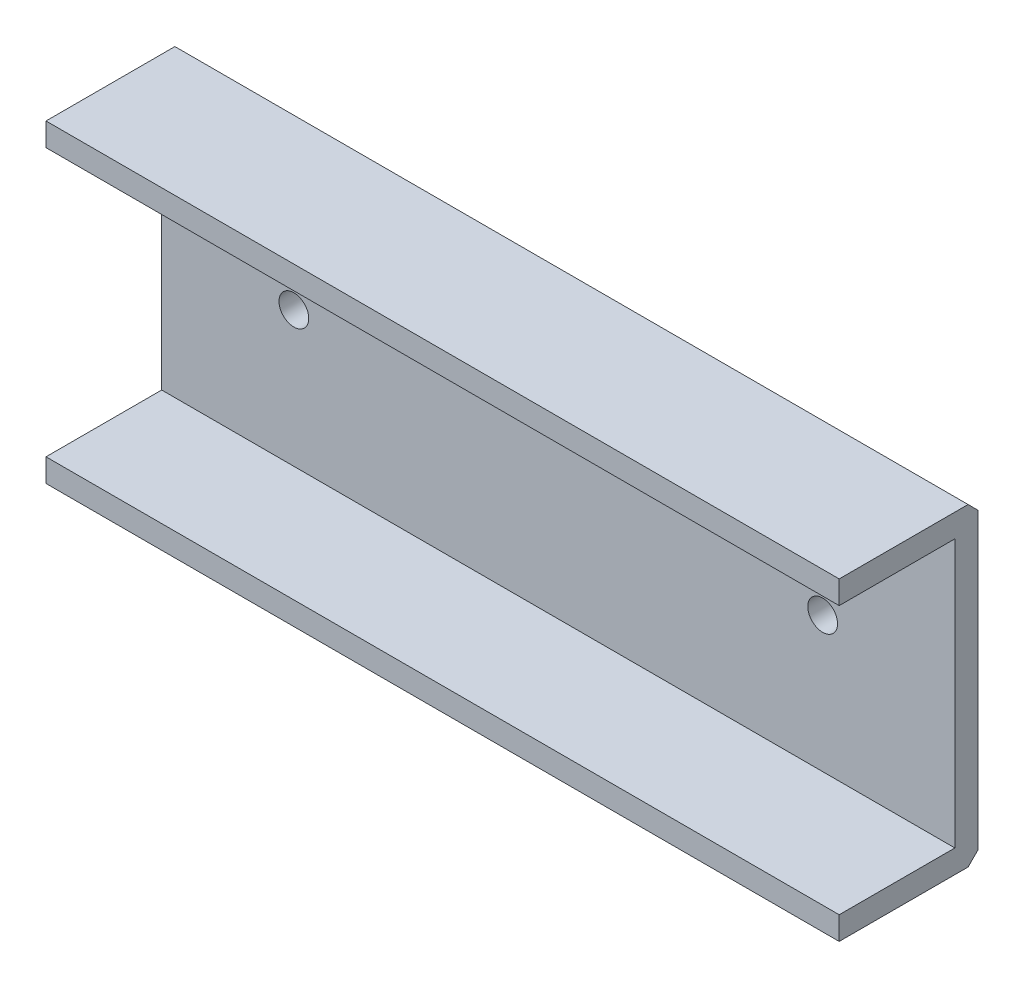
ISO-10303-21;
HEADER;
FILE_DESCRIPTION(('STEP AP214'),'2;1');
FILE_NAME('part.step','',(''),(''),'','','');
FILE_SCHEMA(('AUTOMOTIVE_DESIGN { 1 0 10303 214 1 1 1 1 }'));
ENDSEC;
DATA;
#1=APPLICATION_CONTEXT('core data for automotive mechanical design processes');
#2=APPLICATION_PROTOCOL_DEFINITION('international standard','automotive_design',2000,#1);
#3=PRODUCT_CONTEXT('',#1,'mechanical');
#4=PRODUCT('Part','Part','',(#3));
#5=PRODUCT_RELATED_PRODUCT_CATEGORY('part','',(#4));
#6=PRODUCT_DEFINITION_FORMATION('','',#4);
#7=PRODUCT_DEFINITION_CONTEXT('part definition',#1,'design');
#8=PRODUCT_DEFINITION('design','',#6,#7);
#9=PRODUCT_DEFINITION_SHAPE('','',#8);
#10=(LENGTH_UNIT() NAMED_UNIT(*) SI_UNIT(.MILLI.,.METRE.));
#11=(NAMED_UNIT(*) PLANE_ANGLE_UNIT() SI_UNIT($,.RADIAN.));
#12=(NAMED_UNIT(*) SI_UNIT($,.STERADIAN.) SOLID_ANGLE_UNIT());
#13=UNCERTAINTY_MEASURE_WITH_UNIT(LENGTH_MEASURE(1.E-05),#10,'distance_accuracy_value','');
#14=(GEOMETRIC_REPRESENTATION_CONTEXT(3) GLOBAL_UNCERTAINTY_ASSIGNED_CONTEXT((#13)) GLOBAL_UNIT_ASSIGNED_CONTEXT((#10,
#11,#12)) REPRESENTATION_CONTEXT('',''));
#15=CARTESIAN_POINT('',(0.,0.,0.));
#16=DIRECTION('',(0.,0.,1.));
#17=DIRECTION('',(1.,0.,0.));
#18=AXIS2_PLACEMENT_3D('',#15,#16,#17);
#19=CARTESIAN_POINT('',(60.,23.75,0.));
#20=DIRECTION('',(0.,-1.,0.));
#21=DIRECTION('',(0.,0.,-1.));
#22=AXIS2_PLACEMENT_3D('',#19,#20,#21);
#23=PLANE('',#22);
#24=DIRECTION('',(0.,0.,1.));
#25=VECTOR('',#24,1.);
#26=CARTESIAN_POINT('',(60.,23.75,0.));
#27=LINE('',#26,#25);
#28=CARTESIAN_POINT('',(60.,23.75,1.49999999999999));
#29=VERTEX_POINT('',#28);
#30=CARTESIAN_POINT('',(60.,23.75,21.));
#31=VERTEX_POINT('',#30);
#32=EDGE_CURVE('E120',#29,#31,#27,.T.);
#33=ORIENTED_EDGE('',*,*,#32,.F.);
#34=DIRECTION('',(-1.,0.,0.));
#35=VECTOR('',#34,1.);
#36=CARTESIAN_POINT('',(60.,23.75,1.49999999999999));
#37=LINE('',#36,#35);
#38=CARTESIAN_POINT('',(-60.,23.75,1.49999999999999));
#39=VERTEX_POINT('',#38);
#40=EDGE_CURVE('E11',#29,#39,#37,.T.);
#41=ORIENTED_EDGE('',*,*,#40,.T.);
#42=DIRECTION('',(0.,0.,1.));
#43=VECTOR('',#42,1.);
#44=CARTESIAN_POINT('',(-60.,23.75,0.));
#45=LINE('',#44,#43);
#46=CARTESIAN_POINT('',(-60.,23.75,21.));
#47=VERTEX_POINT('',#46);
#48=EDGE_CURVE('E142',#39,#47,#45,.T.);
#49=ORIENTED_EDGE('',*,*,#48,.T.);
#50=DIRECTION('',(-1.,0.,0.));
#51=VECTOR('',#50,1.);
#52=CARTESIAN_POINT('',(60.,23.75,21.));
#53=LINE('',#52,#51);
#54=EDGE_CURVE('E134',#31,#47,#53,.T.);
#55=ORIENTED_EDGE('',*,*,#54,.F.);
#56=EDGE_LOOP('',(#33,#41,#49,#55));
#57=FACE_BOUND('',#56,.T.);
#58=ADVANCED_FACE('F41',(#57),#23,.F.);
#59=CARTESIAN_POINT('',(60.,23.75,21.));
#60=DIRECTION('',(0.,0.,-1.));
#61=DIRECTION('',(-1.,0.,0.));
#62=AXIS2_PLACEMENT_3D('',#59,#60,#61);
#63=PLANE('',#62);
#64=DIRECTION('',(0.,-1.,0.));
#65=VECTOR('',#64,1.);
#66=CARTESIAN_POINT('',(-60.,23.75,21.));
#67=LINE('',#66,#65);
#68=CARTESIAN_POINT('',(-60.,20.25,21.));
#69=VERTEX_POINT('',#68);
#70=EDGE_CURVE('E228',#47,#69,#67,.T.);
#71=ORIENTED_EDGE('',*,*,#70,.T.);
#72=DIRECTION('',(-1.,0.,0.));
#73=VECTOR('',#72,1.);
#74=CARTESIAN_POINT('',(60.,20.25,21.));
#75=LINE('',#74,#73);
#76=CARTESIAN_POINT('',(60.,20.25,21.));
#77=VERTEX_POINT('',#76);
#78=EDGE_CURVE('E136',#77,#69,#75,.T.);
#79=ORIENTED_EDGE('',*,*,#78,.F.);
#80=DIRECTION('',(0.,-1.,0.));
#81=VECTOR('',#80,1.);
#82=CARTESIAN_POINT('',(60.,23.75,21.));
#83=LINE('',#82,#81);
#84=EDGE_CURVE('E123',#31,#77,#83,.T.);
#85=ORIENTED_EDGE('',*,*,#84,.F.);
#86=ORIENTED_EDGE('',*,*,#54,.T.);
#87=EDGE_LOOP('',(#71,#79,#85,#86));
#88=FACE_BOUND('',#87,.T.);
#89=ADVANCED_FACE('F133',(#88),#63,.F.);
#90=CARTESIAN_POINT('',(60.,20.25,21.));
#91=DIRECTION('',(0.,1.,0.));
#92=DIRECTION('',(0.,0.,1.));
#93=AXIS2_PLACEMENT_3D('',#90,#91,#92);
#94=PLANE('',#93);
#95=DIRECTION('',(0.,0.,-1.));
#96=VECTOR('',#95,1.);
#97=CARTESIAN_POINT('',(-60.,20.25,21.));
#98=LINE('',#97,#96);
#99=CARTESIAN_POINT('',(-60.,20.25,3.5));
#100=VERTEX_POINT('',#99);
#101=EDGE_CURVE('E223',#69,#100,#98,.T.);
#102=ORIENTED_EDGE('',*,*,#101,.T.);
#103=DIRECTION('',(-1.,0.,0.));
#104=VECTOR('',#103,1.);
#105=CARTESIAN_POINT('',(60.,20.25,3.5));
#106=LINE('',#105,#104);
#107=CARTESIAN_POINT('',(60.,20.25,3.5));
#108=VERTEX_POINT('',#107);
#109=EDGE_CURVE('E151',#108,#100,#106,.T.);
#110=ORIENTED_EDGE('',*,*,#109,.F.);
#111=DIRECTION('',(0.,0.,-1.));
#112=VECTOR('',#111,1.);
#113=CARTESIAN_POINT('',(60.,20.25,21.));
#114=LINE('',#113,#112);
#115=EDGE_CURVE('E139',#77,#108,#114,.T.);
#116=ORIENTED_EDGE('',*,*,#115,.F.);
#117=ORIENTED_EDGE('',*,*,#78,.T.);
#118=EDGE_LOOP('',(#102,#110,#116,#117));
#119=FACE_BOUND('',#118,.T.);
#120=ADVANCED_FACE('F276',(#119),#94,.F.);
#121=CARTESIAN_POINT('',(60.,20.25,3.5));
#122=DIRECTION('',(0.,0.,-1.));
#123=DIRECTION('',(0.,1.,0.));
#124=AXIS2_PLACEMENT_3D('',#121,#122,#123);
#125=PLANE('',#124);
#126=CARTESIAN_POINT('',(-40.,0.250000000000001,3.5));
#127=DIRECTION('',(0.,0.,1.));
#128=DIRECTION('',(1.,0.,0.));
#129=AXIS2_PLACEMENT_3D('',#126,#127,#128);
#130=CIRCLE('',#129,2.25);
#131=CARTESIAN_POINT('',(-37.75,0.250000000000001,3.5));
#132=VERTEX_POINT('',#131);
#133=EDGE_CURVE('E256',#132,#132,#130,.T.);
#134=ORIENTED_EDGE('',*,*,#133,.F.);
#135=EDGE_LOOP('',(#134));
#136=FACE_BOUND('',#135,.T.);
#137=CARTESIAN_POINT('',(40.,0.250000000000001,3.5));
#138=DIRECTION('',(0.,0.,1.));
#139=DIRECTION('',(-1.,0.,0.));
#140=AXIS2_PLACEMENT_3D('',#137,#138,#139);
#141=CIRCLE('',#140,2.25);
#142=CARTESIAN_POINT('',(37.75,0.250000000000001,3.5));
#143=VERTEX_POINT('',#142);
#144=EDGE_CURVE('E248',#143,#143,#141,.T.);
#145=ORIENTED_EDGE('',*,*,#144,.F.);
#146=EDGE_LOOP('',(#145));
#147=FACE_BOUND('',#146,.T.);
#148=DIRECTION('',(0.,-1.,0.));
#149=VECTOR('',#148,1.);
#150=CARTESIAN_POINT('',(-60.,20.25,3.5));
#151=LINE('',#150,#149);
#152=CARTESIAN_POINT('',(-60.,-20.25,3.5));
#153=VERTEX_POINT('',#152);
#154=EDGE_CURVE('E218',#100,#153,#151,.T.);
#155=ORIENTED_EDGE('',*,*,#154,.T.);
#156=DIRECTION('',(-1.,0.,0.));
#157=VECTOR('',#156,1.);
#158=CARTESIAN_POINT('',(60.,-20.25,3.5));
#159=LINE('',#158,#157);
#160=CARTESIAN_POINT('',(60.,-20.25,3.5));
#161=VERTEX_POINT('',#160);
#162=EDGE_CURVE('E207',#161,#153,#159,.T.);
#163=ORIENTED_EDGE('',*,*,#162,.F.);
#164=DIRECTION('',(0.,-1.,0.));
#165=VECTOR('',#164,1.);
#166=CARTESIAN_POINT('',(60.,20.25,3.5));
#167=LINE('',#166,#165);
#168=EDGE_CURVE('E219',#108,#161,#167,.T.);
#169=ORIENTED_EDGE('',*,*,#168,.F.);
#170=ORIENTED_EDGE('',*,*,#109,.T.);
#171=EDGE_LOOP('',(#155,#163,#169,#170));
#172=FACE_BOUND('',#171,.T.);
#173=ADVANCED_FACE('F216',(#136,#147,#172),#125,.F.);
#174=CARTESIAN_POINT('',(60.,-20.25,3.5));
#175=DIRECTION('',(0.,-1.,0.));
#176=DIRECTION('',(0.,0.,-1.));
#177=AXIS2_PLACEMENT_3D('',#174,#175,#176);
#178=PLANE('',#177);
#179=DIRECTION('',(0.,0.,1.));
#180=VECTOR('',#179,1.);
#181=CARTESIAN_POINT('',(-60.,-20.25,3.5));
#182=LINE('',#181,#180);
#183=CARTESIAN_POINT('',(-60.,-20.25,21.));
#184=VERTEX_POINT('',#183);
#185=EDGE_CURVE('E197',#153,#184,#182,.T.);
#186=ORIENTED_EDGE('',*,*,#185,.T.);
#187=DIRECTION('',(-1.,0.,0.));
#188=VECTOR('',#187,1.);
#189=CARTESIAN_POINT('',(60.,-20.25,21.));
#190=LINE('',#189,#188);
#191=CARTESIAN_POINT('',(60.,-20.25,21.));
#192=VERTEX_POINT('',#191);
#193=EDGE_CURVE('E203',#192,#184,#190,.T.);
#194=ORIENTED_EDGE('',*,*,#193,.F.);
#195=DIRECTION('',(0.,0.,1.));
#196=VECTOR('',#195,1.);
#197=CARTESIAN_POINT('',(60.,-20.25,3.5));
#198=LINE('',#197,#196);
#199=EDGE_CURVE('E241',#161,#192,#198,.T.);
#200=ORIENTED_EDGE('',*,*,#199,.F.);
#201=ORIENTED_EDGE('',*,*,#162,.T.);
#202=EDGE_LOOP('',(#186,#194,#200,#201));
#203=FACE_BOUND('',#202,.T.);
#204=ADVANCED_FACE('F275',(#203),#178,.F.);
#205=CARTESIAN_POINT('',(60.,-20.25,21.));
#206=DIRECTION('',(0.,0.,-1.));
#207=DIRECTION('',(-1.,0.,0.));
#208=AXIS2_PLACEMENT_3D('',#205,#206,#207);
#209=PLANE('',#208);
#210=DIRECTION('',(0.,-1.,0.));
#211=VECTOR('',#210,1.);
#212=CARTESIAN_POINT('',(-60.,-20.25,21.));
#213=LINE('',#212,#211);
#214=CARTESIAN_POINT('',(-60.,-23.75,21.));
#215=VERTEX_POINT('',#214);
#216=EDGE_CURVE('E192',#184,#215,#213,.T.);
#217=ORIENTED_EDGE('',*,*,#216,.T.);
#218=DIRECTION('',(-1.,0.,0.));
#219=VECTOR('',#218,1.);
#220=CARTESIAN_POINT('',(60.,-23.75,21.));
#221=LINE('',#220,#219);
#222=CARTESIAN_POINT('',(60.,-23.75,21.));
#223=VERTEX_POINT('',#222);
#224=EDGE_CURVE('E180',#223,#215,#221,.T.);
#225=ORIENTED_EDGE('',*,*,#224,.F.);
#226=DIRECTION('',(0.,-1.,0.));
#227=VECTOR('',#226,1.);
#228=CARTESIAN_POINT('',(60.,-20.25,21.));
#229=LINE('',#228,#227);
#230=EDGE_CURVE('E238',#192,#223,#229,.T.);
#231=ORIENTED_EDGE('',*,*,#230,.F.);
#232=ORIENTED_EDGE('',*,*,#193,.T.);
#233=EDGE_LOOP('',(#217,#225,#231,#232));
#234=FACE_BOUND('',#233,.T.);
#235=ADVANCED_FACE('F312',(#234),#209,.F.);
#236=CARTESIAN_POINT('',(60.,-23.75,21.));
#237=DIRECTION('',(0.,1.,0.));
#238=DIRECTION('',(0.,0.,1.));
#239=AXIS2_PLACEMENT_3D('',#236,#237,#238);
#240=PLANE('',#239);
#241=DIRECTION('',(0.,0.,-1.));
#242=VECTOR('',#241,1.);
#243=CARTESIAN_POINT('',(-60.,-23.75,21.));
#244=LINE('',#243,#242);
#245=CARTESIAN_POINT('',(-60.,-23.75,1.50000000000003));
#246=VERTEX_POINT('',#245);
#247=EDGE_CURVE('E187',#215,#246,#244,.T.);
#248=ORIENTED_EDGE('',*,*,#247,.T.);
#249=DIRECTION('',(1.,0.,0.));
#250=VECTOR('',#249,1.);
#251=CARTESIAN_POINT('',(60.,-23.75,1.50000000000003));
#252=LINE('',#251,#250);
#253=CARTESIAN_POINT('',(60.,-23.75,1.50000000000003));
#254=VERTEX_POINT('',#253);
#255=EDGE_CURVE('E66',#246,#254,#252,.T.);
#256=ORIENTED_EDGE('',*,*,#255,.T.);
#257=DIRECTION('',(0.,0.,-1.));
#258=VECTOR('',#257,1.);
#259=CARTESIAN_POINT('',(60.,-23.75,21.));
#260=LINE('',#259,#258);
#261=EDGE_CURVE('E171',#223,#254,#260,.T.);
#262=ORIENTED_EDGE('',*,*,#261,.F.);
#263=ORIENTED_EDGE('',*,*,#224,.T.);
#264=EDGE_LOOP('',(#248,#256,#262,#263));
#265=FACE_BOUND('',#264,.T.);
#266=ADVANCED_FACE('F189',(#265),#240,.F.);
#267=CARTESIAN_POINT('',(60.,-23.75,0.));
#268=DIRECTION('',(0.,0.,1.));
#269=DIRECTION('',(0.,-1.,0.));
#270=AXIS2_PLACEMENT_3D('',#267,#268,#269);
#271=PLANE('',#270);
#272=CARTESIAN_POINT('',(-40.,0.250000000000001,0.));
#273=DIRECTION('',(0.,0.,1.));
#274=DIRECTION('',(1.,0.,0.));
#275=AXIS2_PLACEMENT_3D('',#272,#273,#274);
#276=CIRCLE('',#275,2.25);
#277=CARTESIAN_POINT('',(-37.75,0.250000000000001,0.));
#278=VERTEX_POINT('',#277);
#279=EDGE_CURVE('E234',#278,#278,#276,.T.);
#280=ORIENTED_EDGE('',*,*,#279,.T.);
#281=EDGE_LOOP('',(#280));
#282=FACE_BOUND('',#281,.T.);
#283=CARTESIAN_POINT('',(40.,0.250000000000001,0.));
#284=DIRECTION('',(0.,0.,1.));
#285=DIRECTION('',(-1.,0.,0.));
#286=AXIS2_PLACEMENT_3D('',#283,#284,#285);
#287=CIRCLE('',#286,2.25);
#288=CARTESIAN_POINT('',(37.75,0.250000000000001,0.));
#289=VERTEX_POINT('',#288);
#290=EDGE_CURVE('E252',#289,#289,#287,.T.);
#291=ORIENTED_EDGE('',*,*,#290,.T.);
#292=EDGE_LOOP('',(#291));
#293=FACE_BOUND('',#292,.T.);
#294=DIRECTION('',(0.,1.,0.));
#295=VECTOR('',#294,1.);
#296=CARTESIAN_POINT('',(60.,-23.75,0.));
#297=LINE('',#296,#295);
#298=CARTESIAN_POINT('',(60.,-22.25,0.));
#299=VERTEX_POINT('',#298);
#300=CARTESIAN_POINT('',(60.,22.25,0.));
#301=VERTEX_POINT('',#300);
#302=EDGE_CURVE('E170',#299,#301,#297,.T.);
#303=ORIENTED_EDGE('',*,*,#302,.F.);
#304=DIRECTION('',(-1.,0.,0.));
#305=VECTOR('',#304,1.);
#306=CARTESIAN_POINT('',(60.,-22.25,0.));
#307=LINE('',#306,#305);
#308=CARTESIAN_POINT('',(-60.,-22.25,0.));
#309=VERTEX_POINT('',#308);
#310=EDGE_CURVE('E149',#299,#309,#307,.T.);
#311=ORIENTED_EDGE('',*,*,#310,.T.);
#312=DIRECTION('',(0.,1.,0.));
#313=VECTOR('',#312,1.);
#314=CARTESIAN_POINT('',(-60.,-23.75,0.));
#315=LINE('',#314,#313);
#316=CARTESIAN_POINT('',(-60.,22.25,0.));
#317=VERTEX_POINT('',#316);
#318=EDGE_CURVE('E129',#309,#317,#315,.T.);
#319=ORIENTED_EDGE('',*,*,#318,.T.);
#320=DIRECTION('',(1.,0.,0.));
#321=VECTOR('',#320,1.);
#322=CARTESIAN_POINT('',(60.,22.25,0.));
#323=LINE('',#322,#321);
#324=EDGE_CURVE('E145',#317,#301,#323,.T.);
#325=ORIENTED_EDGE('',*,*,#324,.T.);
#326=EDGE_LOOP('',(#303,#311,#319,#325));
#327=FACE_BOUND('',#326,.T.);
#328=ADVANCED_FACE('F175',(#282,#293,#327),#271,.F.);
#329=CARTESIAN_POINT('',(60.,0.,0.));
#330=DIRECTION('',(1.,0.,0.));
#331=DIRECTION('',(0.,0.,-1.));
#332=AXIS2_PLACEMENT_3D('',#329,#330,#331);
#333=PLANE('',#332);
#334=ORIENTED_EDGE('',*,*,#261,.T.);
#335=DIRECTION('',(0.,-0.707106781186541,0.707106781186554));
#336=VECTOR('',#335,1.);
#337=CARTESIAN_POINT('',(60.,-11.1250000000002,-11.125));
#338=LINE('',#337,#336);
#339=EDGE_CURVE('E51',#254,#299,#338,.F.);
#340=ORIENTED_EDGE('',*,*,#339,.T.);
#341=ORIENTED_EDGE('',*,*,#302,.T.);
#342=DIRECTION('',(0.,-0.707106781186551,-0.707106781186544));
#343=VECTOR('',#342,1.);
#344=CARTESIAN_POINT('',(60.,11.1249999999999,-11.125));
#345=LINE('',#344,#343);
#346=EDGE_CURVE('E58',#301,#29,#345,.F.);
#347=ORIENTED_EDGE('',*,*,#346,.T.);
#348=ORIENTED_EDGE('',*,*,#32,.T.);
#349=ORIENTED_EDGE('',*,*,#84,.T.);
#350=ORIENTED_EDGE('',*,*,#115,.T.);
#351=ORIENTED_EDGE('',*,*,#168,.T.);
#352=ORIENTED_EDGE('',*,*,#199,.T.);
#353=ORIENTED_EDGE('',*,*,#230,.T.);
#354=EDGE_LOOP('',(#334,#340,#341,#347,#348,#349,#350,#351,#352,#353));
#355=FACE_BOUND('',#354,.T.);
#356=ADVANCED_FACE('F122',(#355),#333,.T.);
#357=CARTESIAN_POINT('',(-60.,0.,0.));
#358=DIRECTION('',(1.,0.,0.));
#359=DIRECTION('',(0.,0.,-1.));
#360=AXIS2_PLACEMENT_3D('',#357,#358,#359);
#361=PLANE('',#360);
#362=ORIENTED_EDGE('',*,*,#318,.F.);
#363=DIRECTION('',(0.,0.707106781186541,-0.707106781186554));
#364=VECTOR('',#363,1.);
#365=CARTESIAN_POINT('',(-60.,-22.25,0.));
#366=LINE('',#365,#364);
#367=EDGE_CURVE('E161',#309,#246,#366,.F.);
#368=ORIENTED_EDGE('',*,*,#367,.T.);
#369=ORIENTED_EDGE('',*,*,#247,.F.);
#370=ORIENTED_EDGE('',*,*,#216,.F.);
#371=ORIENTED_EDGE('',*,*,#185,.F.);
#372=ORIENTED_EDGE('',*,*,#154,.F.);
#373=ORIENTED_EDGE('',*,*,#101,.F.);
#374=ORIENTED_EDGE('',*,*,#70,.F.);
#375=ORIENTED_EDGE('',*,*,#48,.F.);
#376=DIRECTION('',(0.,0.707106781186551,0.707106781186544));
#377=VECTOR('',#376,1.);
#378=CARTESIAN_POINT('',(-60.,23.75,1.49999999999999));
#379=LINE('',#378,#377);
#380=EDGE_CURVE('E158',#39,#317,#379,.F.);
#381=ORIENTED_EDGE('',*,*,#380,.T.);
#382=EDGE_LOOP('',(#362,#368,#369,#370,#371,#372,#373,#374,#375,#381));
#383=FACE_BOUND('',#382,.T.);
#384=ADVANCED_FACE('F185',(#383),#361,.F.);
#385=CARTESIAN_POINT('',(60.,-22.25,0.));
#386=DIRECTION('',(0.,0.707106781186554,0.707106781186541));
#387=DIRECTION('',(-1.,0.,0.));
#388=AXIS2_PLACEMENT_3D('',#385,#386,#387);
#389=PLANE('',#388);
#390=ORIENTED_EDGE('',*,*,#339,.F.);
#391=ORIENTED_EDGE('',*,*,#255,.F.);
#392=ORIENTED_EDGE('',*,*,#367,.F.);
#393=ORIENTED_EDGE('',*,*,#310,.F.);
#394=EDGE_LOOP('',(#390,#391,#392,#393));
#395=FACE_BOUND('',#394,.T.);
#396=ADVANCED_FACE('F182',(#395),#389,.F.);
#397=CARTESIAN_POINT('',(60.,23.75,1.49999999999999));
#398=DIRECTION('',(0.,-0.707106781186544,0.707106781186551));
#399=DIRECTION('',(-1.,0.,0.));
#400=AXIS2_PLACEMENT_3D('',#397,#398,#399);
#401=PLANE('',#400);
#402=ORIENTED_EDGE('',*,*,#346,.F.);
#403=ORIENTED_EDGE('',*,*,#324,.F.);
#404=ORIENTED_EDGE('',*,*,#380,.F.);
#405=ORIENTED_EDGE('',*,*,#40,.F.);
#406=EDGE_LOOP('',(#402,#403,#404,#405));
#407=FACE_BOUND('',#406,.T.);
#408=ADVANCED_FACE('F44',(#407),#401,.F.);
#409=CARTESIAN_POINT('',(40.,0.250000000000001,0.));
#410=DIRECTION('',(0.,0.,1.));
#411=DIRECTION('',(1.,0.,0.));
#412=AXIS2_PLACEMENT_3D('',#409,#410,#411);
#413=CYLINDRICAL_SURFACE('',#412,2.25);
#414=ORIENTED_EDGE('',*,*,#290,.F.);
#415=EDGE_LOOP('',(#414));
#416=FACE_BOUND('',#415,.T.);
#417=ORIENTED_EDGE('',*,*,#144,.T.);
#418=EDGE_LOOP('',(#417));
#419=FACE_BOUND('',#418,.T.);
#420=ADVANCED_FACE('F269',(#416,#419),#413,.F.);
#421=CARTESIAN_POINT('',(-40.,0.250000000000001,0.));
#422=DIRECTION('',(0.,0.,1.));
#423=DIRECTION('',(1.,0.,0.));
#424=AXIS2_PLACEMENT_3D('',#421,#422,#423);
#425=CYLINDRICAL_SURFACE('',#424,2.25);
#426=ORIENTED_EDGE('',*,*,#279,.F.);
#427=EDGE_LOOP('',(#426));
#428=FACE_BOUND('',#427,.T.);
#429=ORIENTED_EDGE('',*,*,#133,.T.);
#430=EDGE_LOOP('',(#429));
#431=FACE_BOUND('',#430,.T.);
#432=ADVANCED_FACE('F266',(#428,#431),#425,.F.);
#433=CLOSED_SHELL('',(#58,#89,#120,#173,#204,#235,#266,#328,#356,#384,#396,#408,#420,#432));
#434=MANIFOLD_SOLID_BREP('B2',#433);
#435=ADVANCED_BREP_SHAPE_REPRESENTATION('',(#18,#434),#14);
#436=SHAPE_DEFINITION_REPRESENTATION(#9,#435);
ENDSEC;
END-ISO-10303-21;
